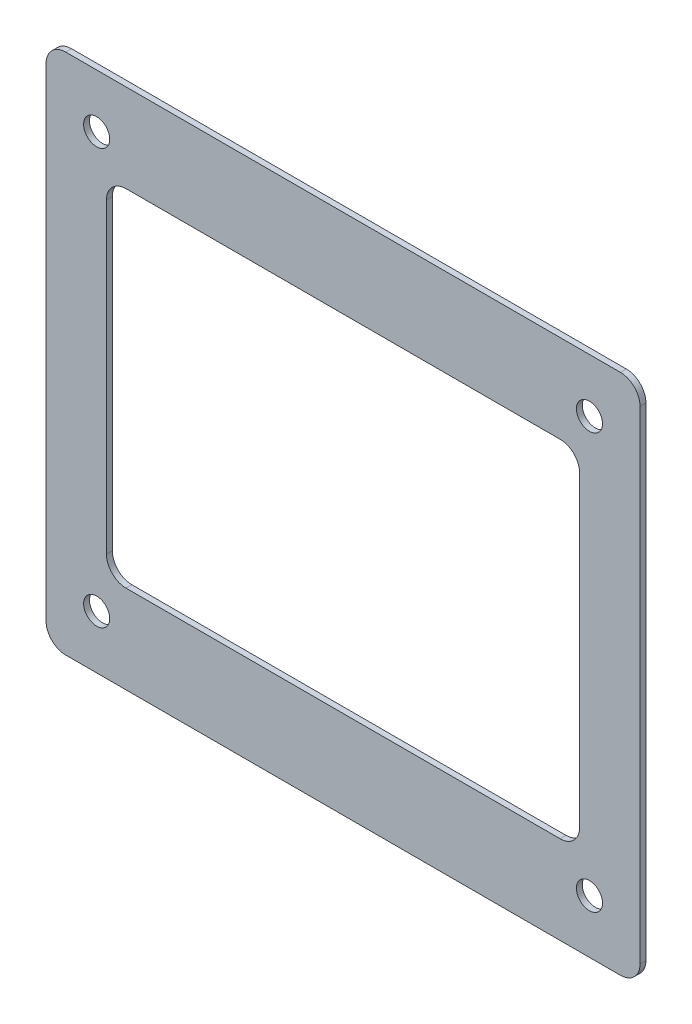
ISO-10303-21;
HEADER;
FILE_DESCRIPTION(('STEP AP214'),'2;1');
FILE_NAME('part.step','',(''),(''),'','','');
FILE_SCHEMA(('AUTOMOTIVE_DESIGN { 1 0 10303 214 1 1 1 1 }'));
ENDSEC;
DATA;
#1=APPLICATION_CONTEXT('core data for automotive mechanical design processes');
#2=APPLICATION_PROTOCOL_DEFINITION('international standard','automotive_design',2000,#1);
#3=PRODUCT_CONTEXT('',#1,'mechanical');
#4=PRODUCT('Part','Part','',(#3));
#5=PRODUCT_RELATED_PRODUCT_CATEGORY('part','',(#4));
#6=PRODUCT_DEFINITION_FORMATION('','',#4);
#7=PRODUCT_DEFINITION_CONTEXT('part definition',#1,'design');
#8=PRODUCT_DEFINITION('design','',#6,#7);
#9=PRODUCT_DEFINITION_SHAPE('','',#8);
#10=(LENGTH_UNIT() NAMED_UNIT(*) SI_UNIT(.MILLI.,.METRE.));
#11=(NAMED_UNIT(*) PLANE_ANGLE_UNIT() SI_UNIT($,.RADIAN.));
#12=(NAMED_UNIT(*) SI_UNIT($,.STERADIAN.) SOLID_ANGLE_UNIT());
#13=UNCERTAINTY_MEASURE_WITH_UNIT(LENGTH_MEASURE(1.E-05),#10,'distance_accuracy_value','');
#14=(GEOMETRIC_REPRESENTATION_CONTEXT(3) GLOBAL_UNCERTAINTY_ASSIGNED_CONTEXT((#13)) GLOBAL_UNIT_ASSIGNED_CONTEXT((#10,
#11,#12)) REPRESENTATION_CONTEXT('',''));
#15=CARTESIAN_POINT('',(0.,0.,0.));
#16=DIRECTION('',(0.,0.,1.));
#17=DIRECTION('',(1.,0.,0.));
#18=AXIS2_PLACEMENT_3D('',#15,#16,#17);
#19=CARTESIAN_POINT('',(42.6760385347077,37.2640578020616,0.9));
#20=DIRECTION('',(0.,0.,1.));
#21=DIRECTION('',(1.,0.,0.));
#22=AXIS2_PLACEMENT_3D('',#19,#20,#21);
#23=PLANE('',#22);
#24=CARTESIAN_POINT('',(37.9260385347077,-31.5359421979384,0.9));
#25=DIRECTION('',(0.,0.,1.));
#26=DIRECTION('',(1.,0.,0.));
#27=AXIS2_PLACEMENT_3D('',#24,#25,#26);
#28=CIRCLE('',#27,2.);
#29=CARTESIAN_POINT('',(39.9260385347077,-31.5359421979384,0.9));
#30=VERTEX_POINT('',#29);
#31=EDGE_CURVE('E388',#30,#30,#28,.T.);
#32=ORIENTED_EDGE('',*,*,#31,.F.);
#33=EDGE_LOOP('',(#32));
#34=FACE_BOUND('',#33,.T.);
#35=CARTESIAN_POINT('',(-37.5739614652923,32.0640578020616,0.9));
#36=DIRECTION('',(0.,0.,1.));
#37=DIRECTION('',(1.,0.,0.));
#38=AXIS2_PLACEMENT_3D('',#35,#36,#37);
#39=CIRCLE('',#38,2.);
#40=CARTESIAN_POINT('',(-35.5739614652923,32.0640578020616,0.9));
#41=VERTEX_POINT('',#40);
#42=EDGE_CURVE('E184',#41,#41,#39,.T.);
#43=ORIENTED_EDGE('',*,*,#42,.F.);
#44=EDGE_LOOP('',(#43));
#45=FACE_BOUND('',#44,.T.);
#46=CARTESIAN_POINT('',(42.6760385347077,37.2640578020616,0.9));
#47=DIRECTION('',(0.,0.,1.));
#48=DIRECTION('',(1.,0.,0.));
#49=AXIS2_PLACEMENT_3D('',#46,#47,#48);
#50=CIRCLE('',#49,3.);
#51=CARTESIAN_POINT('',(45.6760385347077,37.2640578020616,0.9));
#52=VERTEX_POINT('',#51);
#53=CARTESIAN_POINT('',(42.6760385347077,40.2640578020616,0.9));
#54=VERTEX_POINT('',#53);
#55=EDGE_CURVE('E214',#52,#54,#50,.T.);
#56=ORIENTED_EDGE('',*,*,#55,.T.);
#57=DIRECTION('',(-1.,0.,0.));
#58=VECTOR('',#57,1.);
#59=CARTESIAN_POINT('',(42.6760385347077,40.2640578020616,0.9));
#60=LINE('',#59,#58);
#61=CARTESIAN_POINT('',(-42.3239614652923,40.2640578020616,0.9));
#62=VERTEX_POINT('',#61);
#63=EDGE_CURVE('E217',#54,#62,#60,.T.);
#64=ORIENTED_EDGE('',*,*,#63,.T.);
#65=CARTESIAN_POINT('',(-42.3239614652923,37.2640578020616,0.9));
#66=DIRECTION('',(0.,0.,1.));
#67=DIRECTION('',(1.,0.,0.));
#68=AXIS2_PLACEMENT_3D('',#65,#66,#67);
#69=CIRCLE('',#68,3.);
#70=CARTESIAN_POINT('',(-45.3239614652923,37.2640578020616,0.9));
#71=VERTEX_POINT('',#70);
#72=EDGE_CURVE('E220',#62,#71,#69,.T.);
#73=ORIENTED_EDGE('',*,*,#72,.T.);
#74=DIRECTION('',(0.,-1.,0.));
#75=VECTOR('',#74,1.);
#76=CARTESIAN_POINT('',(-45.3239614652923,37.2640578020616,0.9));
#77=LINE('',#76,#75);
#78=CARTESIAN_POINT('',(-45.3239614652923,-36.7359421979384,0.9));
#79=VERTEX_POINT('',#78);
#80=EDGE_CURVE('E222',#71,#79,#77,.T.);
#81=ORIENTED_EDGE('',*,*,#80,.T.);
#82=CARTESIAN_POINT('',(-42.3239614652923,-36.7359421979384,0.9));
#83=DIRECTION('',(0.,0.,1.));
#84=DIRECTION('',(1.,0.,0.));
#85=AXIS2_PLACEMENT_3D('',#82,#83,#84);
#86=CIRCLE('',#85,3.);
#87=CARTESIAN_POINT('',(-42.3239614652923,-39.7359421979384,0.9));
#88=VERTEX_POINT('',#87);
#89=EDGE_CURVE('E224',#79,#88,#86,.T.);
#90=ORIENTED_EDGE('',*,*,#89,.T.);
#91=DIRECTION('',(1.,0.,0.));
#92=VECTOR('',#91,1.);
#93=CARTESIAN_POINT('',(-42.3239614652923,-39.7359421979384,0.9));
#94=LINE('',#93,#92);
#95=CARTESIAN_POINT('',(42.6760385347077,-39.7359421979384,0.9));
#96=VERTEX_POINT('',#95);
#97=EDGE_CURVE('E226',#88,#96,#94,.T.);
#98=ORIENTED_EDGE('',*,*,#97,.T.);
#99=CARTESIAN_POINT('',(42.6760385347077,-36.7359421979384,0.9));
#100=DIRECTION('',(0.,0.,1.));
#101=DIRECTION('',(1.,0.,0.));
#102=AXIS2_PLACEMENT_3D('',#99,#100,#101);
#103=CIRCLE('',#102,3.);
#104=CARTESIAN_POINT('',(45.6760385347077,-36.7359421979384,0.9));
#105=VERTEX_POINT('',#104);
#106=EDGE_CURVE('E228',#96,#105,#103,.T.);
#107=ORIENTED_EDGE('',*,*,#106,.T.);
#108=DIRECTION('',(0.,1.,0.));
#109=VECTOR('',#108,1.);
#110=CARTESIAN_POINT('',(45.6760385347077,-36.7359421979384,0.9));
#111=LINE('',#110,#109);
#112=EDGE_CURVE('E230',#105,#52,#111,.T.);
#113=ORIENTED_EDGE('',*,*,#112,.T.);
#114=EDGE_LOOP('',(#56,#64,#73,#81,#90,#98,#107,#113));
#115=FACE_BOUND('',#114,.T.);
#116=DIRECTION('',(0.,-1.,0.));
#117=VECTOR('',#116,1.);
#118=CARTESIAN_POINT('',(-36.0739614652922,23.7640578020616,0.9));
#119=LINE('',#118,#117);
#120=CARTESIAN_POINT('',(-36.0739614652922,23.7640578020616,0.9));
#121=VERTEX_POINT('',#120);
#122=CARTESIAN_POINT('',(-36.0739614652922,-23.2359421979384,0.9));
#123=VERTEX_POINT('',#122);
#124=EDGE_CURVE('E154',#121,#123,#119,.T.);
#125=ORIENTED_EDGE('',*,*,#124,.F.);
#126=CARTESIAN_POINT('',(-33.0739614652922,23.7640578020616,0.9));
#127=DIRECTION('',(0.,0.,1.));
#128=DIRECTION('',(1.,0.,0.));
#129=AXIS2_PLACEMENT_3D('',#126,#127,#128);
#130=CIRCLE('',#129,3.);
#131=CARTESIAN_POINT('',(-33.0739614652922,26.7640578020616,0.9));
#132=VERTEX_POINT('',#131);
#133=EDGE_CURVE('E146',#132,#121,#130,.T.);
#134=ORIENTED_EDGE('',*,*,#133,.F.);
#135=DIRECTION('',(-1.,0.,0.));
#136=VECTOR('',#135,1.);
#137=CARTESIAN_POINT('',(33.4260385347078,26.7640578020616,0.9));
#138=LINE('',#137,#136);
#139=CARTESIAN_POINT('',(33.4260385347078,26.7640578020616,0.9));
#140=VERTEX_POINT('',#139);
#141=EDGE_CURVE('E181',#140,#132,#138,.T.);
#142=ORIENTED_EDGE('',*,*,#141,.F.);
#143=CARTESIAN_POINT('',(33.4260385347078,23.7640578020616,0.9));
#144=DIRECTION('',(0.,0.,1.));
#145=DIRECTION('',(1.,0.,0.));
#146=AXIS2_PLACEMENT_3D('',#143,#144,#145);
#147=CIRCLE('',#146,2.99999999999999);
#148=CARTESIAN_POINT('',(36.4260385347078,23.7640578020616,0.9));
#149=VERTEX_POINT('',#148);
#150=EDGE_CURVE('E179',#149,#140,#147,.T.);
#151=ORIENTED_EDGE('',*,*,#150,.F.);
#152=DIRECTION('',(0.,1.,0.));
#153=VECTOR('',#152,1.);
#154=CARTESIAN_POINT('',(36.4260385347078,-23.2359421979384,0.9));
#155=LINE('',#154,#153);
#156=CARTESIAN_POINT('',(36.4260385347078,-23.2359421979384,0.9));
#157=VERTEX_POINT('',#156);
#158=EDGE_CURVE('E177',#157,#149,#155,.T.);
#159=ORIENTED_EDGE('',*,*,#158,.F.);
#160=CARTESIAN_POINT('',(33.4260385347078,-23.2359421979384,0.9));
#161=DIRECTION('',(0.,0.,1.));
#162=DIRECTION('',(1.,0.,0.));
#163=AXIS2_PLACEMENT_3D('',#160,#161,#162);
#164=CIRCLE('',#163,3.);
#165=CARTESIAN_POINT('',(33.4260385347078,-26.2359421979384,0.9));
#166=VERTEX_POINT('',#165);
#167=EDGE_CURVE('E175',#166,#157,#164,.T.);
#168=ORIENTED_EDGE('',*,*,#167,.F.);
#169=DIRECTION('',(1.,0.,0.));
#170=VECTOR('',#169,1.);
#171=CARTESIAN_POINT('',(-33.0739614652922,-26.2359421979384,0.9));
#172=LINE('',#171,#170);
#173=CARTESIAN_POINT('',(-33.0739614652922,-26.2359421979384,0.9));
#174=VERTEX_POINT('',#173);
#175=EDGE_CURVE('E170',#174,#166,#172,.T.);
#176=ORIENTED_EDGE('',*,*,#175,.F.);
#177=CARTESIAN_POINT('',(-33.0739614652922,-23.2359421979384,0.9));
#178=DIRECTION('',(0.,0.,1.));
#179=DIRECTION('',(1.,0.,0.));
#180=AXIS2_PLACEMENT_3D('',#177,#178,#179);
#181=CIRCLE('',#180,3.);
#182=EDGE_CURVE('E168',#123,#174,#181,.T.);
#183=ORIENTED_EDGE('',*,*,#182,.F.);
#184=EDGE_LOOP('',(#125,#134,#142,#151,#159,#168,#176,#183));
#185=FACE_BOUND('',#184,.T.);
#186=CARTESIAN_POINT('',(37.9260385347077,32.0640578020616,0.9));
#187=DIRECTION('',(0.,0.,1.));
#188=DIRECTION('',(1.,0.,0.));
#189=AXIS2_PLACEMENT_3D('',#186,#187,#188);
#190=CIRCLE('',#189,2.);
#191=CARTESIAN_POINT('',(39.9260385347077,32.0640578020616,0.9));
#192=VERTEX_POINT('',#191);
#193=EDGE_CURVE('E394',#192,#192,#190,.T.);
#194=ORIENTED_EDGE('',*,*,#193,.F.);
#195=EDGE_LOOP('',(#194));
#196=FACE_BOUND('',#195,.T.);
#197=CARTESIAN_POINT('',(-37.5739614652923,-31.5359421979384,0.9));
#198=DIRECTION('',(0.,0.,1.));
#199=DIRECTION('',(1.,0.,0.));
#200=AXIS2_PLACEMENT_3D('',#197,#198,#199);
#201=CIRCLE('',#200,2.);
#202=CARTESIAN_POINT('',(-35.5739614652923,-31.5359421979384,0.9));
#203=VERTEX_POINT('',#202);
#204=EDGE_CURVE('E379',#203,#203,#201,.T.);
#205=ORIENTED_EDGE('',*,*,#204,.F.);
#206=EDGE_LOOP('',(#205));
#207=FACE_BOUND('',#206,.T.);
#208=ADVANCED_FACE('F33',(#34,#45,#115,#185,#196,#207),#23,.T.);
#209=CARTESIAN_POINT('',(42.6760385347077,37.2640578020616,0.));
#210=DIRECTION('',(0.,0.,1.));
#211=DIRECTION('',(1.,0.,0.));
#212=AXIS2_PLACEMENT_3D('',#209,#210,#211);
#213=PLANE('',#212);
#214=CARTESIAN_POINT('',(42.6760385347077,37.2640578020616,0.));
#215=DIRECTION('',(0.,0.,1.));
#216=DIRECTION('',(1.,0.,0.));
#217=AXIS2_PLACEMENT_3D('',#214,#215,#216);
#218=CIRCLE('',#217,3.);
#219=CARTESIAN_POINT('',(45.6760385347077,37.2640578020616,0.));
#220=VERTEX_POINT('',#219);
#221=CARTESIAN_POINT('',(42.6760385347077,40.2640578020616,0.));
#222=VERTEX_POINT('',#221);
#223=EDGE_CURVE('E162',#220,#222,#218,.T.);
#224=ORIENTED_EDGE('',*,*,#223,.F.);
#225=DIRECTION('',(0.,1.,0.));
#226=VECTOR('',#225,1.);
#227=CARTESIAN_POINT('',(45.6760385347077,-36.7359421979384,0.));
#228=LINE('',#227,#226);
#229=CARTESIAN_POINT('',(45.6760385347077,-36.7359421979384,0.));
#230=VERTEX_POINT('',#229);
#231=EDGE_CURVE('E218',#230,#220,#228,.T.);
#232=ORIENTED_EDGE('',*,*,#231,.F.);
#233=CARTESIAN_POINT('',(42.6760385347077,-36.7359421979384,0.));
#234=DIRECTION('',(0.,0.,1.));
#235=DIRECTION('',(1.,0.,0.));
#236=AXIS2_PLACEMENT_3D('',#233,#234,#235);
#237=CIRCLE('',#236,3.);
#238=CARTESIAN_POINT('',(42.6760385347077,-39.7359421979384,0.));
#239=VERTEX_POINT('',#238);
#240=EDGE_CURVE('E245',#239,#230,#237,.T.);
#241=ORIENTED_EDGE('',*,*,#240,.F.);
#242=DIRECTION('',(1.,0.,0.));
#243=VECTOR('',#242,1.);
#244=CARTESIAN_POINT('',(-42.3239614652923,-39.7359421979384,0.));
#245=LINE('',#244,#243);
#246=CARTESIAN_POINT('',(-42.3239614652923,-39.7359421979384,0.));
#247=VERTEX_POINT('',#246);
#248=EDGE_CURVE('E243',#247,#239,#245,.T.);
#249=ORIENTED_EDGE('',*,*,#248,.F.);
#250=CARTESIAN_POINT('',(-42.3239614652923,-36.7359421979384,0.));
#251=DIRECTION('',(0.,0.,1.));
#252=DIRECTION('',(1.,0.,0.));
#253=AXIS2_PLACEMENT_3D('',#250,#251,#252);
#254=CIRCLE('',#253,3.);
#255=CARTESIAN_POINT('',(-45.3239614652923,-36.7359421979384,0.));
#256=VERTEX_POINT('',#255);
#257=EDGE_CURVE('E241',#256,#247,#254,.T.);
#258=ORIENTED_EDGE('',*,*,#257,.F.);
#259=DIRECTION('',(0.,-1.,0.));
#260=VECTOR('',#259,1.);
#261=CARTESIAN_POINT('',(-45.3239614652923,37.2640578020616,0.));
#262=LINE('',#261,#260);
#263=CARTESIAN_POINT('',(-45.3239614652923,37.2640578020616,0.));
#264=VERTEX_POINT('',#263);
#265=EDGE_CURVE('E239',#264,#256,#262,.T.);
#266=ORIENTED_EDGE('',*,*,#265,.F.);
#267=CARTESIAN_POINT('',(-42.3239614652923,37.2640578020616,0.));
#268=DIRECTION('',(0.,0.,1.));
#269=DIRECTION('',(1.,0.,0.));
#270=AXIS2_PLACEMENT_3D('',#267,#268,#269);
#271=CIRCLE('',#270,3.);
#272=CARTESIAN_POINT('',(-42.3239614652923,40.2640578020616,0.));
#273=VERTEX_POINT('',#272);
#274=EDGE_CURVE('E237',#273,#264,#271,.T.);
#275=ORIENTED_EDGE('',*,*,#274,.F.);
#276=DIRECTION('',(-1.,0.,0.));
#277=VECTOR('',#276,1.);
#278=CARTESIAN_POINT('',(42.6760385347077,40.2640578020616,0.));
#279=LINE('',#278,#277);
#280=EDGE_CURVE('E235',#222,#273,#279,.T.);
#281=ORIENTED_EDGE('',*,*,#280,.F.);
#282=EDGE_LOOP('',(#224,#232,#241,#249,#258,#266,#275,#281));
#283=FACE_BOUND('',#282,.T.);
#284=CARTESIAN_POINT('',(-33.0739614652922,23.7640578020616,0.));
#285=DIRECTION('',(0.,0.,1.));
#286=DIRECTION('',(1.,0.,0.));
#287=AXIS2_PLACEMENT_3D('',#284,#285,#286);
#288=CIRCLE('',#287,3.);
#289=CARTESIAN_POINT('',(-33.0739614652922,26.7640578020616,0.));
#290=VERTEX_POINT('',#289);
#291=CARTESIAN_POINT('',(-36.0739614652922,23.7640578020616,0.));
#292=VERTEX_POINT('',#291);
#293=EDGE_CURVE('E56',#290,#292,#288,.T.);
#294=ORIENTED_EDGE('',*,*,#293,.T.);
#295=DIRECTION('',(0.,-1.,0.));
#296=VECTOR('',#295,1.);
#297=CARTESIAN_POINT('',(-36.0739614652922,23.7640578020616,0.));
#298=LINE('',#297,#296);
#299=CARTESIAN_POINT('',(-36.0739614652922,-23.2359421979384,0.));
#300=VERTEX_POINT('',#299);
#301=EDGE_CURVE('E161',#292,#300,#298,.T.);
#302=ORIENTED_EDGE('',*,*,#301,.T.);
#303=CARTESIAN_POINT('',(-33.0739614652922,-23.2359421979384,0.));
#304=DIRECTION('',(0.,0.,1.));
#305=DIRECTION('',(1.,0.,0.));
#306=AXIS2_PLACEMENT_3D('',#303,#304,#305);
#307=CIRCLE('',#306,3.);
#308=CARTESIAN_POINT('',(-33.0739614652922,-26.2359421979384,0.));
#309=VERTEX_POINT('',#308);
#310=EDGE_CURVE('E186',#300,#309,#307,.T.);
#311=ORIENTED_EDGE('',*,*,#310,.T.);
#312=DIRECTION('',(1.,0.,0.));
#313=VECTOR('',#312,1.);
#314=CARTESIAN_POINT('',(-33.0739614652922,-26.2359421979384,0.));
#315=LINE('',#314,#313);
#316=CARTESIAN_POINT('',(33.4260385347078,-26.2359421979384,0.));
#317=VERTEX_POINT('',#316);
#318=EDGE_CURVE('E189',#309,#317,#315,.T.);
#319=ORIENTED_EDGE('',*,*,#318,.T.);
#320=CARTESIAN_POINT('',(33.4260385347078,-23.2359421979384,0.));
#321=DIRECTION('',(0.,0.,1.));
#322=DIRECTION('',(1.,0.,0.));
#323=AXIS2_PLACEMENT_3D('',#320,#321,#322);
#324=CIRCLE('',#323,3.);
#325=CARTESIAN_POINT('',(36.4260385347078,-23.2359421979384,0.));
#326=VERTEX_POINT('',#325);
#327=EDGE_CURVE('E192',#317,#326,#324,.T.);
#328=ORIENTED_EDGE('',*,*,#327,.T.);
#329=DIRECTION('',(0.,1.,0.));
#330=VECTOR('',#329,1.);
#331=CARTESIAN_POINT('',(36.4260385347078,-23.2359421979384,0.));
#332=LINE('',#331,#330);
#333=CARTESIAN_POINT('',(36.4260385347078,23.7640578020616,0.));
#334=VERTEX_POINT('',#333);
#335=EDGE_CURVE('E195',#326,#334,#332,.T.);
#336=ORIENTED_EDGE('',*,*,#335,.T.);
#337=CARTESIAN_POINT('',(33.4260385347078,23.7640578020616,0.));
#338=DIRECTION('',(0.,0.,1.));
#339=DIRECTION('',(1.,0.,0.));
#340=AXIS2_PLACEMENT_3D('',#337,#338,#339);
#341=CIRCLE('',#340,2.99999999999999);
#342=CARTESIAN_POINT('',(33.4260385347078,26.7640578020616,0.));
#343=VERTEX_POINT('',#342);
#344=EDGE_CURVE('E198',#334,#343,#341,.T.);
#345=ORIENTED_EDGE('',*,*,#344,.T.);
#346=DIRECTION('',(-1.,0.,0.));
#347=VECTOR('',#346,1.);
#348=CARTESIAN_POINT('',(33.4260385347078,26.7640578020616,0.));
#349=LINE('',#348,#347);
#350=EDGE_CURVE('E155',#343,#290,#349,.T.);
#351=ORIENTED_EDGE('',*,*,#350,.T.);
#352=EDGE_LOOP('',(#294,#302,#311,#319,#328,#336,#345,#351));
#353=FACE_BOUND('',#352,.T.);
#354=CARTESIAN_POINT('',(-37.5739614652923,32.0640578020616,0.));
#355=DIRECTION('',(0.,0.,1.));
#356=DIRECTION('',(1.,0.,0.));
#357=AXIS2_PLACEMENT_3D('',#354,#355,#356);
#358=CIRCLE('',#357,2.);
#359=CARTESIAN_POINT('',(-35.5739614652923,32.0640578020616,0.));
#360=VERTEX_POINT('',#359);
#361=EDGE_CURVE('E397',#360,#360,#358,.T.);
#362=ORIENTED_EDGE('',*,*,#361,.T.);
#363=EDGE_LOOP('',(#362));
#364=FACE_BOUND('',#363,.T.);
#365=CARTESIAN_POINT('',(37.9260385347077,32.0640578020616,0.));
#366=DIRECTION('',(0.,0.,1.));
#367=DIRECTION('',(1.,0.,0.));
#368=AXIS2_PLACEMENT_3D('',#365,#366,#367);
#369=CIRCLE('',#368,2.);
#370=CARTESIAN_POINT('',(39.9260385347077,32.0640578020616,0.));
#371=VERTEX_POINT('',#370);
#372=EDGE_CURVE('E391',#371,#371,#369,.T.);
#373=ORIENTED_EDGE('',*,*,#372,.T.);
#374=EDGE_LOOP('',(#373));
#375=FACE_BOUND('',#374,.T.);
#376=CARTESIAN_POINT('',(37.9260385347077,-31.5359421979384,0.));
#377=DIRECTION('',(0.,0.,1.));
#378=DIRECTION('',(1.,0.,0.));
#379=AXIS2_PLACEMENT_3D('',#376,#377,#378);
#380=CIRCLE('',#379,2.);
#381=CARTESIAN_POINT('',(39.9260385347077,-31.5359421979384,0.));
#382=VERTEX_POINT('',#381);
#383=EDGE_CURVE('E385',#382,#382,#380,.T.);
#384=ORIENTED_EDGE('',*,*,#383,.T.);
#385=EDGE_LOOP('',(#384));
#386=FACE_BOUND('',#385,.T.);
#387=CARTESIAN_POINT('',(-37.5739614652923,-31.5359421979384,0.));
#388=DIRECTION('',(0.,0.,1.));
#389=DIRECTION('',(1.,0.,0.));
#390=AXIS2_PLACEMENT_3D('',#387,#388,#389);
#391=CIRCLE('',#390,2.);
#392=CARTESIAN_POINT('',(-35.5739614652923,-31.5359421979384,0.));
#393=VERTEX_POINT('',#392);
#394=EDGE_CURVE('E382',#393,#393,#391,.T.);
#395=ORIENTED_EDGE('',*,*,#394,.T.);
#396=EDGE_LOOP('',(#395));
#397=FACE_BOUND('',#396,.T.);
#398=ADVANCED_FACE('F275',(#283,#353,#364,#375,#386,#397),#213,.F.);
#399=CARTESIAN_POINT('',(42.6760385347077,37.2640578020616,0.9));
#400=DIRECTION('',(0.,0.,-1.));
#401=DIRECTION('',(-1.,0.,0.));
#402=AXIS2_PLACEMENT_3D('',#399,#400,#401);
#403=CYLINDRICAL_SURFACE('',#402,3.);
#404=ORIENTED_EDGE('',*,*,#223,.T.);
#405=DIRECTION('',(0.,0.,-1.));
#406=VECTOR('',#405,1.);
#407=CARTESIAN_POINT('',(42.6760385347077,40.2640578020616,0.9));
#408=LINE('',#407,#406);
#409=EDGE_CURVE('E11',#54,#222,#408,.T.);
#410=ORIENTED_EDGE('',*,*,#409,.F.);
#411=ORIENTED_EDGE('',*,*,#55,.F.);
#412=DIRECTION('',(0.,0.,-1.));
#413=VECTOR('',#412,1.);
#414=CARTESIAN_POINT('',(45.6760385347077,37.2640578020616,0.9));
#415=LINE('',#414,#413);
#416=EDGE_CURVE('E232',#52,#220,#415,.T.);
#417=ORIENTED_EDGE('',*,*,#416,.T.);
#418=EDGE_LOOP('',(#404,#410,#411,#417));
#419=FACE_BOUND('',#418,.T.);
#420=ADVANCED_FACE('F35',(#419),#403,.T.);
#421=CARTESIAN_POINT('',(42.6760385347077,40.2640578020616,0.9));
#422=DIRECTION('',(0.,-1.,0.));
#423=DIRECTION('',(1.,0.,0.));
#424=AXIS2_PLACEMENT_3D('',#421,#422,#423);
#425=PLANE('',#424);
#426=ORIENTED_EDGE('',*,*,#280,.T.);
#427=DIRECTION('',(0.,0.,-1.));
#428=VECTOR('',#427,1.);
#429=CARTESIAN_POINT('',(-42.3239614652923,40.2640578020616,0.9));
#430=LINE('',#429,#428);
#431=EDGE_CURVE('E41',#62,#273,#430,.T.);
#432=ORIENTED_EDGE('',*,*,#431,.F.);
#433=ORIENTED_EDGE('',*,*,#63,.F.);
#434=ORIENTED_EDGE('',*,*,#409,.T.);
#435=EDGE_LOOP('',(#426,#432,#433,#434));
#436=FACE_BOUND('',#435,.T.);
#437=ADVANCED_FACE('F292',(#436),#425,.F.);
#438=CARTESIAN_POINT('',(-42.3239614652923,37.2640578020616,0.9));
#439=DIRECTION('',(0.,0.,-1.));
#440=DIRECTION('',(-1.,0.,0.));
#441=AXIS2_PLACEMENT_3D('',#438,#439,#440);
#442=CYLINDRICAL_SURFACE('',#441,3.);
#443=ORIENTED_EDGE('',*,*,#274,.T.);
#444=DIRECTION('',(0.,0.,-1.));
#445=VECTOR('',#444,1.);
#446=CARTESIAN_POINT('',(-45.3239614652923,37.2640578020616,0.9));
#447=LINE('',#446,#445);
#448=EDGE_CURVE('E262',#71,#264,#447,.T.);
#449=ORIENTED_EDGE('',*,*,#448,.F.);
#450=ORIENTED_EDGE('',*,*,#72,.F.);
#451=ORIENTED_EDGE('',*,*,#431,.T.);
#452=EDGE_LOOP('',(#443,#449,#450,#451));
#453=FACE_BOUND('',#452,.T.);
#454=ADVANCED_FACE('F269',(#453),#442,.T.);
#455=CARTESIAN_POINT('',(-45.3239614652923,37.2640578020616,0.9));
#456=DIRECTION('',(1.,0.,0.));
#457=DIRECTION('',(0.,0.,-1.));
#458=AXIS2_PLACEMENT_3D('',#455,#456,#457);
#459=PLANE('',#458);
#460=ORIENTED_EDGE('',*,*,#265,.T.);
#461=DIRECTION('',(0.,0.,-1.));
#462=VECTOR('',#461,1.);
#463=CARTESIAN_POINT('',(-45.3239614652923,-36.7359421979384,0.9));
#464=LINE('',#463,#462);
#465=EDGE_CURVE('E259',#79,#256,#464,.T.);
#466=ORIENTED_EDGE('',*,*,#465,.F.);
#467=ORIENTED_EDGE('',*,*,#80,.F.);
#468=ORIENTED_EDGE('',*,*,#448,.T.);
#469=EDGE_LOOP('',(#460,#466,#467,#468));
#470=FACE_BOUND('',#469,.T.);
#471=ADVANCED_FACE('F281',(#470),#459,.F.);
#472=CARTESIAN_POINT('',(-42.3239614652923,-36.7359421979384,0.9));
#473=DIRECTION('',(0.,0.,-1.));
#474=DIRECTION('',(-1.,0.,0.));
#475=AXIS2_PLACEMENT_3D('',#472,#473,#474);
#476=CYLINDRICAL_SURFACE('',#475,3.);
#477=ORIENTED_EDGE('',*,*,#257,.T.);
#478=DIRECTION('',(0.,0.,-1.));
#479=VECTOR('',#478,1.);
#480=CARTESIAN_POINT('',(-42.3239614652923,-39.7359421979384,0.9));
#481=LINE('',#480,#479);
#482=EDGE_CURVE('E256',#88,#247,#481,.T.);
#483=ORIENTED_EDGE('',*,*,#482,.F.);
#484=ORIENTED_EDGE('',*,*,#89,.F.);
#485=ORIENTED_EDGE('',*,*,#465,.T.);
#486=EDGE_LOOP('',(#477,#483,#484,#485));
#487=FACE_BOUND('',#486,.T.);
#488=ADVANCED_FACE('F285',(#487),#476,.T.);
#489=CARTESIAN_POINT('',(-42.3239614652923,-39.7359421979384,0.9));
#490=DIRECTION('',(0.,1.,0.));
#491=DIRECTION('',(-1.,0.,0.));
#492=AXIS2_PLACEMENT_3D('',#489,#490,#491);
#493=PLANE('',#492);
#494=ORIENTED_EDGE('',*,*,#248,.T.);
#495=DIRECTION('',(0.,0.,-1.));
#496=VECTOR('',#495,1.);
#497=CARTESIAN_POINT('',(42.6760385347077,-39.7359421979384,0.9));
#498=LINE('',#497,#496);
#499=EDGE_CURVE('E253',#96,#239,#498,.T.);
#500=ORIENTED_EDGE('',*,*,#499,.F.);
#501=ORIENTED_EDGE('',*,*,#97,.F.);
#502=ORIENTED_EDGE('',*,*,#482,.T.);
#503=EDGE_LOOP('',(#494,#500,#501,#502));
#504=FACE_BOUND('',#503,.T.);
#505=ADVANCED_FACE('F305',(#504),#493,.F.);
#506=CARTESIAN_POINT('',(42.6760385347077,-36.7359421979384,0.9));
#507=DIRECTION('',(0.,0.,-1.));
#508=DIRECTION('',(-1.,0.,0.));
#509=AXIS2_PLACEMENT_3D('',#506,#507,#508);
#510=CYLINDRICAL_SURFACE('',#509,3.);
#511=ORIENTED_EDGE('',*,*,#240,.T.);
#512=DIRECTION('',(0.,0.,-1.));
#513=VECTOR('',#512,1.);
#514=CARTESIAN_POINT('',(45.6760385347077,-36.7359421979384,0.9));
#515=LINE('',#514,#513);
#516=EDGE_CURVE('E250',#105,#230,#515,.T.);
#517=ORIENTED_EDGE('',*,*,#516,.F.);
#518=ORIENTED_EDGE('',*,*,#106,.F.);
#519=ORIENTED_EDGE('',*,*,#499,.T.);
#520=EDGE_LOOP('',(#511,#517,#518,#519));
#521=FACE_BOUND('',#520,.T.);
#522=ADVANCED_FACE('F303',(#521),#510,.T.);
#523=CARTESIAN_POINT('',(45.6760385347077,-36.7359421979384,0.9));
#524=DIRECTION('',(-1.,0.,0.));
#525=DIRECTION('',(0.,0.,1.));
#526=AXIS2_PLACEMENT_3D('',#523,#524,#525);
#527=PLANE('',#526);
#528=ORIENTED_EDGE('',*,*,#231,.T.);
#529=ORIENTED_EDGE('',*,*,#416,.F.);
#530=ORIENTED_EDGE('',*,*,#112,.F.);
#531=ORIENTED_EDGE('',*,*,#516,.T.);
#532=EDGE_LOOP('',(#528,#529,#530,#531));
#533=FACE_BOUND('',#532,.T.);
#534=ADVANCED_FACE('F298',(#533),#527,.F.);
#535=CARTESIAN_POINT('',(-33.0739614652922,23.7640578020616,0.9));
#536=DIRECTION('',(0.,0.,-1.));
#537=DIRECTION('',(-1.,0.,0.));
#538=AXIS2_PLACEMENT_3D('',#535,#536,#537);
#539=CYLINDRICAL_SURFACE('',#538,3.);
#540=ORIENTED_EDGE('',*,*,#293,.F.);
#541=DIRECTION('',(0.,0.,-1.));
#542=VECTOR('',#541,1.);
#543=CARTESIAN_POINT('',(-33.0739614652922,26.7640578020616,0.9));
#544=LINE('',#543,#542);
#545=EDGE_CURVE('E150',#132,#290,#544,.T.);
#546=ORIENTED_EDGE('',*,*,#545,.F.);
#547=ORIENTED_EDGE('',*,*,#133,.T.);
#548=DIRECTION('',(0.,0.,-1.));
#549=VECTOR('',#548,1.);
#550=CARTESIAN_POINT('',(-36.0739614652922,23.7640578020616,0.9));
#551=LINE('',#550,#549);
#552=EDGE_CURVE('E149',#121,#292,#551,.T.);
#553=ORIENTED_EDGE('',*,*,#552,.T.);
#554=EDGE_LOOP('',(#540,#546,#547,#553));
#555=FACE_BOUND('',#554,.T.);
#556=ADVANCED_FACE('F148',(#555),#539,.F.);
#557=CARTESIAN_POINT('',(-36.0739614652922,23.7640578020616,0.9));
#558=DIRECTION('',(1.,0.,0.));
#559=DIRECTION('',(0.,1.,0.));
#560=AXIS2_PLACEMENT_3D('',#557,#558,#559);
#561=PLANE('',#560);
#562=ORIENTED_EDGE('',*,*,#301,.F.);
#563=ORIENTED_EDGE('',*,*,#552,.F.);
#564=ORIENTED_EDGE('',*,*,#124,.T.);
#565=DIRECTION('',(0.,0.,-1.));
#566=VECTOR('',#565,1.);
#567=CARTESIAN_POINT('',(-36.0739614652922,-23.2359421979384,0.9));
#568=LINE('',#567,#566);
#569=EDGE_CURVE('E163',#123,#300,#568,.T.);
#570=ORIENTED_EDGE('',*,*,#569,.T.);
#571=EDGE_LOOP('',(#562,#563,#564,#570));
#572=FACE_BOUND('',#571,.T.);
#573=ADVANCED_FACE('F158',(#572),#561,.T.);
#574=CARTESIAN_POINT('',(-33.0739614652922,-23.2359421979384,0.9));
#575=DIRECTION('',(0.,0.,-1.));
#576=DIRECTION('',(-1.,0.,0.));
#577=AXIS2_PLACEMENT_3D('',#574,#575,#576);
#578=CYLINDRICAL_SURFACE('',#577,3.);
#579=ORIENTED_EDGE('',*,*,#310,.F.);
#580=ORIENTED_EDGE('',*,*,#569,.F.);
#581=ORIENTED_EDGE('',*,*,#182,.T.);
#582=DIRECTION('',(0.,0.,-1.));
#583=VECTOR('',#582,1.);
#584=CARTESIAN_POINT('',(-33.0739614652922,-26.2359421979384,0.9));
#585=LINE('',#584,#583);
#586=EDGE_CURVE('E211',#174,#309,#585,.T.);
#587=ORIENTED_EDGE('',*,*,#586,.T.);
#588=EDGE_LOOP('',(#579,#580,#581,#587));
#589=FACE_BOUND('',#588,.T.);
#590=ADVANCED_FACE('F333',(#589),#578,.F.);
#591=CARTESIAN_POINT('',(-33.0739614652922,-26.2359421979384,0.9));
#592=DIRECTION('',(0.,1.,0.));
#593=DIRECTION('',(0.,0.,1.));
#594=AXIS2_PLACEMENT_3D('',#591,#592,#593);
#595=PLANE('',#594);
#596=ORIENTED_EDGE('',*,*,#318,.F.);
#597=ORIENTED_EDGE('',*,*,#586,.F.);
#598=ORIENTED_EDGE('',*,*,#175,.T.);
#599=DIRECTION('',(0.,0.,-1.));
#600=VECTOR('',#599,1.);
#601=CARTESIAN_POINT('',(33.4260385347078,-26.2359421979384,0.9));
#602=LINE('',#601,#600);
#603=EDGE_CURVE('E209',#166,#317,#602,.T.);
#604=ORIENTED_EDGE('',*,*,#603,.T.);
#605=EDGE_LOOP('',(#596,#597,#598,#604));
#606=FACE_BOUND('',#605,.T.);
#607=ADVANCED_FACE('F337',(#606),#595,.T.);
#608=CARTESIAN_POINT('',(33.4260385347078,-23.2359421979384,0.9));
#609=DIRECTION('',(0.,0.,-1.));
#610=DIRECTION('',(-1.,0.,0.));
#611=AXIS2_PLACEMENT_3D('',#608,#609,#610);
#612=CYLINDRICAL_SURFACE('',#611,3.);
#613=ORIENTED_EDGE('',*,*,#327,.F.);
#614=ORIENTED_EDGE('',*,*,#603,.F.);
#615=ORIENTED_EDGE('',*,*,#167,.T.);
#616=DIRECTION('',(0.,0.,-1.));
#617=VECTOR('',#616,1.);
#618=CARTESIAN_POINT('',(36.4260385347078,-23.2359421979384,0.9));
#619=LINE('',#618,#617);
#620=EDGE_CURVE('E207',#157,#326,#619,.T.);
#621=ORIENTED_EDGE('',*,*,#620,.T.);
#622=EDGE_LOOP('',(#613,#614,#615,#621));
#623=FACE_BOUND('',#622,.T.);
#624=ADVANCED_FACE('F343',(#623),#612,.F.);
#625=CARTESIAN_POINT('',(36.4260385347078,-23.2359421979384,0.9));
#626=DIRECTION('',(-1.,0.,0.));
#627=DIRECTION('',(0.,-1.,0.));
#628=AXIS2_PLACEMENT_3D('',#625,#626,#627);
#629=PLANE('',#628);
#630=ORIENTED_EDGE('',*,*,#335,.F.);
#631=ORIENTED_EDGE('',*,*,#620,.F.);
#632=ORIENTED_EDGE('',*,*,#158,.T.);
#633=DIRECTION('',(0.,0.,-1.));
#634=VECTOR('',#633,1.);
#635=CARTESIAN_POINT('',(36.4260385347078,23.7640578020616,0.9));
#636=LINE('',#635,#634);
#637=EDGE_CURVE('E205',#149,#334,#636,.T.);
#638=ORIENTED_EDGE('',*,*,#637,.T.);
#639=EDGE_LOOP('',(#630,#631,#632,#638));
#640=FACE_BOUND('',#639,.T.);
#641=ADVANCED_FACE('F347',(#640),#629,.T.);
#642=CARTESIAN_POINT('',(33.4260385347078,23.7640578020616,0.9));
#643=DIRECTION('',(0.,0.,-1.));
#644=DIRECTION('',(-1.,0.,0.));
#645=AXIS2_PLACEMENT_3D('',#642,#643,#644);
#646=CYLINDRICAL_SURFACE('',#645,2.99999999999999);
#647=ORIENTED_EDGE('',*,*,#344,.F.);
#648=ORIENTED_EDGE('',*,*,#637,.F.);
#649=ORIENTED_EDGE('',*,*,#150,.T.);
#650=DIRECTION('',(0.,0.,-1.));
#651=VECTOR('',#650,1.);
#652=CARTESIAN_POINT('',(33.4260385347078,26.7640578020616,0.9));
#653=LINE('',#652,#651);
#654=EDGE_CURVE('E48',#140,#343,#653,.T.);
#655=ORIENTED_EDGE('',*,*,#654,.T.);
#656=EDGE_LOOP('',(#647,#648,#649,#655));
#657=FACE_BOUND('',#656,.T.);
#658=ADVANCED_FACE('F351',(#657),#646,.F.);
#659=CARTESIAN_POINT('',(33.4260385347078,26.7640578020616,0.9));
#660=DIRECTION('',(0.,-1.,0.));
#661=DIRECTION('',(0.,0.,-1.));
#662=AXIS2_PLACEMENT_3D('',#659,#660,#661);
#663=PLANE('',#662);
#664=ORIENTED_EDGE('',*,*,#350,.F.);
#665=ORIENTED_EDGE('',*,*,#654,.F.);
#666=ORIENTED_EDGE('',*,*,#141,.T.);
#667=ORIENTED_EDGE('',*,*,#545,.T.);
#668=EDGE_LOOP('',(#664,#665,#666,#667));
#669=FACE_BOUND('',#668,.T.);
#670=ADVANCED_FACE('F355',(#669),#663,.T.);
#671=CARTESIAN_POINT('',(-37.5739614652923,32.0640578020616,0.9));
#672=DIRECTION('',(0.,0.,-1.));
#673=DIRECTION('',(-1.,0.,0.));
#674=AXIS2_PLACEMENT_3D('',#671,#672,#673);
#675=CYLINDRICAL_SURFACE('',#674,2.);
#676=ORIENTED_EDGE('',*,*,#42,.T.);
#677=EDGE_LOOP('',(#676));
#678=FACE_BOUND('',#677,.T.);
#679=ORIENTED_EDGE('',*,*,#361,.F.);
#680=EDGE_LOOP('',(#679));
#681=FACE_BOUND('',#680,.T.);
#682=ADVANCED_FACE('F359',(#678,#681),#675,.F.);
#683=CARTESIAN_POINT('',(37.9260385347077,32.0640578020616,0.9));
#684=DIRECTION('',(0.,0.,-1.));
#685=DIRECTION('',(-1.,0.,0.));
#686=AXIS2_PLACEMENT_3D('',#683,#684,#685);
#687=CYLINDRICAL_SURFACE('',#686,2.);
#688=ORIENTED_EDGE('',*,*,#193,.T.);
#689=EDGE_LOOP('',(#688));
#690=FACE_BOUND('',#689,.T.);
#691=ORIENTED_EDGE('',*,*,#372,.F.);
#692=EDGE_LOOP('',(#691));
#693=FACE_BOUND('',#692,.T.);
#694=ADVANCED_FACE('F362',(#690,#693),#687,.F.);
#695=CARTESIAN_POINT('',(37.9260385347077,-31.5359421979384,0.9));
#696=DIRECTION('',(0.,0.,-1.));
#697=DIRECTION('',(-1.,0.,0.));
#698=AXIS2_PLACEMENT_3D('',#695,#696,#697);
#699=CYLINDRICAL_SURFACE('',#698,2.);
#700=ORIENTED_EDGE('',*,*,#31,.T.);
#701=EDGE_LOOP('',(#700));
#702=FACE_BOUND('',#701,.T.);
#703=ORIENTED_EDGE('',*,*,#383,.F.);
#704=EDGE_LOOP('',(#703));
#705=FACE_BOUND('',#704,.T.);
#706=ADVANCED_FACE('F366',(#702,#705),#699,.F.);
#707=CARTESIAN_POINT('',(-37.5739614652923,-31.5359421979384,0.9));
#708=DIRECTION('',(0.,0.,-1.));
#709=DIRECTION('',(-1.,0.,0.));
#710=AXIS2_PLACEMENT_3D('',#707,#708,#709);
#711=CYLINDRICAL_SURFACE('',#710,2.);
#712=ORIENTED_EDGE('',*,*,#204,.T.);
#713=EDGE_LOOP('',(#712));
#714=FACE_BOUND('',#713,.T.);
#715=ORIENTED_EDGE('',*,*,#394,.F.);
#716=EDGE_LOOP('',(#715));
#717=FACE_BOUND('',#716,.T.);
#718=ADVANCED_FACE('F370',(#714,#717),#711,.F.);
#719=CLOSED_SHELL('',(#208,#398,#420,#437,#454,#471,#488,#505,#522,#534,#556,#573,#590,#607,
#624,#641,#658,#670,#682,#694,#706,#718));
#720=MANIFOLD_SOLID_BREP('B2',#719);
#721=ADVANCED_BREP_SHAPE_REPRESENTATION('',(#18,#720),#14);
#722=SHAPE_DEFINITION_REPRESENTATION(#9,#721);
ENDSEC;
END-ISO-10303-21;
